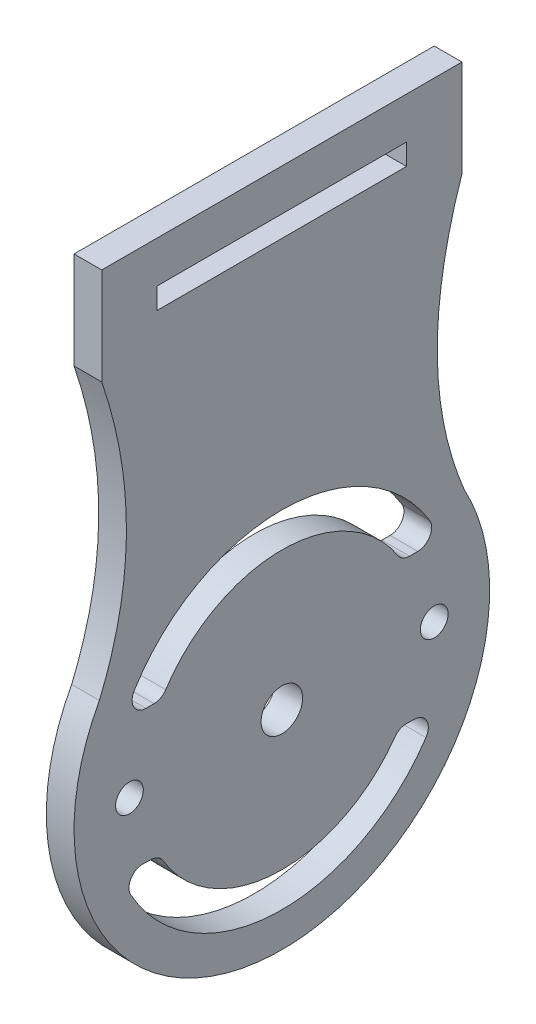
ISO-10303-21;
HEADER;
FILE_DESCRIPTION(('STEP AP214'),'2;1');
FILE_NAME('part.step','',(''),(''),'','','');
FILE_SCHEMA(('AUTOMOTIVE_DESIGN { 1 0 10303 214 1 1 1 1 }'));
ENDSEC;
DATA;
#1=APPLICATION_CONTEXT('core data for automotive mechanical design processes');
#2=APPLICATION_PROTOCOL_DEFINITION('international standard','automotive_design',2000,#1);
#3=PRODUCT_CONTEXT('',#1,'mechanical');
#4=PRODUCT('Part','Part','',(#3));
#5=PRODUCT_RELATED_PRODUCT_CATEGORY('part','',(#4));
#6=PRODUCT_DEFINITION_FORMATION('','',#4);
#7=PRODUCT_DEFINITION_CONTEXT('part definition',#1,'design');
#8=PRODUCT_DEFINITION('design','',#6,#7);
#9=PRODUCT_DEFINITION_SHAPE('','',#8);
#10=(LENGTH_UNIT() NAMED_UNIT(*) SI_UNIT(.MILLI.,.METRE.));
#11=(NAMED_UNIT(*) PLANE_ANGLE_UNIT() SI_UNIT($,.RADIAN.));
#12=(NAMED_UNIT(*) SI_UNIT($,.STERADIAN.) SOLID_ANGLE_UNIT());
#13=UNCERTAINTY_MEASURE_WITH_UNIT(LENGTH_MEASURE(1.E-05),#10,'distance_accuracy_value','');
#14=(GEOMETRIC_REPRESENTATION_CONTEXT(3) GLOBAL_UNCERTAINTY_ASSIGNED_CONTEXT((#13)) GLOBAL_UNIT_ASSIGNED_CONTEXT((#10,
#11,#12)) REPRESENTATION_CONTEXT('',''));
#15=CARTESIAN_POINT('',(0.,0.,0.));
#16=DIRECTION('',(0.,0.,1.));
#17=DIRECTION('',(1.,0.,0.));
#18=AXIS2_PLACEMENT_3D('',#15,#16,#17);
#19=CARTESIAN_POINT('',(2.,27.,13.));
#20=CARTESIAN_POINT('',(2.,16.2399641619766,9.3541994142272));
#21=CARTESIAN_POINT('',(2.,7.1726349857079,13.1739632366953));
#22=B_SPLINE_CURVE_WITH_KNOTS('',2,(#19,#20,#21),.UNSPECIFIED.,.F.,.F.,(3,3),(0.,
0.912495845409906),.UNSPECIFIED.);
#23=DIRECTION('',(-1.,0.,0.));
#24=VECTOR('',#23,1.);
#25=SURFACE_OF_LINEAR_EXTRUSION('',#22,#24);
#26=CARTESIAN_POINT('',(0.,27.,13.));
#27=CARTESIAN_POINT('',(0.,16.2399641619766,9.3541994142272));
#28=CARTESIAN_POINT('',(0.,7.1726349857079,13.1739632366953));
#29=B_SPLINE_CURVE_WITH_KNOTS('',2,(#26,#27,#28),.UNSPECIFIED.,.F.,.F.,(3,3),(0.,
0.912495845409906),.UNSPECIFIED.);
#30=CARTESIAN_POINT('',(0.,27.,13.));
#31=VERTEX_POINT('',#30);
#32=CARTESIAN_POINT('',(0.,7.1726349857079,13.1739632366953));
#33=VERTEX_POINT('',#32);
#34=EDGE_CURVE('E425',#31,#33,#29,.T.);
#35=ORIENTED_EDGE('',*,*,#34,.T.);
#36=DIRECTION('',(-1.,0.,0.));
#37=VECTOR('',#36,1.);
#38=CARTESIAN_POINT('',(2.,7.1726349857079,13.1739632366953));
#39=LINE('',#38,#37);
#40=CARTESIAN_POINT('',(2.,7.1726349857079,13.1739632366953));
#41=VERTEX_POINT('',#40);
#42=EDGE_CURVE('E11',#41,#33,#39,.T.);
#43=ORIENTED_EDGE('',*,*,#42,.F.);
#44=CARTESIAN_POINT('',(2.,27.,13.));
#45=VERTEX_POINT('',#44);
#46=EDGE_CURVE('E443',#45,#41,#22,.T.);
#47=ORIENTED_EDGE('',*,*,#46,.F.);
#48=DIRECTION('',(-1.,0.,0.));
#49=VECTOR('',#48,1.);
#50=CARTESIAN_POINT('',(2.,27.,13.));
#51=LINE('',#50,#49);
#52=EDGE_CURVE('E459',#45,#31,#51,.T.);
#53=ORIENTED_EDGE('',*,*,#52,.T.);
#54=EDGE_LOOP('',(#35,#43,#47,#53));
#55=FACE_BOUND('',#54,.T.);
#56=ADVANCED_FACE('F32',(#55),#25,.F.);
#57=CARTESIAN_POINT('',(2.,0.,0.));
#58=DIRECTION('',(-1.,0.,0.));
#59=DIRECTION('',(0.,0.,1.));
#60=AXIS2_PLACEMENT_3D('',#57,#58,#59);
#61=CYLINDRICAL_SURFACE('',#60,15.);
#62=CARTESIAN_POINT('',(0.,0.,0.));
#63=DIRECTION('',(1.,0.,0.));
#64=DIRECTION('',(0.,0.,-1.));
#65=AXIS2_PLACEMENT_3D('',#62,#63,#64);
#66=CIRCLE('',#65,15.);
#67=CARTESIAN_POINT('',(0.,7.1726349857079,-13.1739632366953));
#68=VERTEX_POINT('',#67);
#69=EDGE_CURVE('E416',#33,#68,#66,.T.);
#70=ORIENTED_EDGE('',*,*,#69,.T.);
#71=DIRECTION('',(-1.,0.,0.));
#72=VECTOR('',#71,1.);
#73=CARTESIAN_POINT('',(2.,7.1726349857079,-13.1739632366953));
#74=LINE('',#73,#72);
#75=CARTESIAN_POINT('',(2.,7.1726349857079,-13.1739632366953));
#76=VERTEX_POINT('',#75);
#77=EDGE_CURVE('E418',#76,#68,#74,.T.);
#78=ORIENTED_EDGE('',*,*,#77,.F.);
#79=CARTESIAN_POINT('',(2.,0.,0.));
#80=DIRECTION('',(1.,0.,0.));
#81=DIRECTION('',(0.,0.,-1.));
#82=AXIS2_PLACEMENT_3D('',#79,#80,#81);
#83=CIRCLE('',#82,15.);
#84=EDGE_CURVE('E449',#41,#76,#83,.T.);
#85=ORIENTED_EDGE('',*,*,#84,.F.);
#86=ORIENTED_EDGE('',*,*,#42,.T.);
#87=EDGE_LOOP('',(#70,#78,#85,#86));
#88=FACE_BOUND('',#87,.T.);
#89=ADVANCED_FACE('F407',(#88),#61,.T.);
#90=CARTESIAN_POINT('',(2.,34.,13.));
#91=DIRECTION('',(0.,-1.,0.));
#92=DIRECTION('',(0.,0.,-1.));
#93=AXIS2_PLACEMENT_3D('',#90,#91,#92);
#94=PLANE('',#93);
#95=DIRECTION('',(0.,0.,1.));
#96=VECTOR('',#95,1.);
#97=CARTESIAN_POINT('',(0.,34.,13.));
#98=LINE('',#97,#96);
#99=CARTESIAN_POINT('',(0.,34.,-13.));
#100=VERTEX_POINT('',#99);
#101=CARTESIAN_POINT('',(0.,34.,13.));
#102=VERTEX_POINT('',#101);
#103=EDGE_CURVE('E424',#100,#102,#98,.T.);
#104=ORIENTED_EDGE('',*,*,#103,.T.);
#105=DIRECTION('',(-1.,0.,0.));
#106=VECTOR('',#105,1.);
#107=CARTESIAN_POINT('',(2.,34.,13.));
#108=LINE('',#107,#106);
#109=CARTESIAN_POINT('',(2.,34.,13.));
#110=VERTEX_POINT('',#109);
#111=EDGE_CURVE('E40',#110,#102,#108,.T.);
#112=ORIENTED_EDGE('',*,*,#111,.F.);
#113=DIRECTION('',(0.,0.,1.));
#114=VECTOR('',#113,1.);
#115=CARTESIAN_POINT('',(2.,34.,13.));
#116=LINE('',#115,#114);
#117=CARTESIAN_POINT('',(2.,34.,-13.));
#118=VERTEX_POINT('',#117);
#119=EDGE_CURVE('E455',#118,#110,#116,.T.);
#120=ORIENTED_EDGE('',*,*,#119,.F.);
#121=DIRECTION('',(-1.,0.,0.));
#122=VECTOR('',#121,1.);
#123=CARTESIAN_POINT('',(2.,34.,-13.));
#124=LINE('',#123,#122);
#125=EDGE_CURVE('E430',#118,#100,#124,.T.);
#126=ORIENTED_EDGE('',*,*,#125,.T.);
#127=EDGE_LOOP('',(#104,#112,#120,#126));
#128=FACE_BOUND('',#127,.T.);
#129=ADVANCED_FACE('F404',(#128),#94,.F.);
#130=CARTESIAN_POINT('',(2.,34.,13.));
#131=DIRECTION('',(0.,0.,-1.));
#132=DIRECTION('',(0.,1.,0.));
#133=AXIS2_PLACEMENT_3D('',#130,#131,#132);
#134=PLANE('',#133);
#135=DIRECTION('',(0.,-1.,0.));
#136=VECTOR('',#135,1.);
#137=CARTESIAN_POINT('',(0.,34.,13.));
#138=LINE('',#137,#136);
#139=EDGE_CURVE('E450',#102,#31,#138,.T.);
#140=ORIENTED_EDGE('',*,*,#139,.T.);
#141=ORIENTED_EDGE('',*,*,#52,.F.);
#142=DIRECTION('',(0.,-1.,0.));
#143=VECTOR('',#142,1.);
#144=CARTESIAN_POINT('',(2.,34.,13.));
#145=LINE('',#144,#143);
#146=EDGE_CURVE('E457',#110,#45,#145,.T.);
#147=ORIENTED_EDGE('',*,*,#146,.F.);
#148=ORIENTED_EDGE('',*,*,#111,.T.);
#149=EDGE_LOOP('',(#140,#141,#147,#148));
#150=FACE_BOUND('',#149,.T.);
#151=ADVANCED_FACE('F397',(#150),#134,.F.);
#152=CARTESIAN_POINT('',(2.,16.6631408274153,11.2205905162874));
#153=DIRECTION('',(1.,0.,0.));
#154=DIRECTION('',(0.,0.,-1.));
#155=AXIS2_PLACEMENT_3D('',#152,#153,#154);
#156=PLANE('',#155);
#157=CARTESIAN_POINT('',(2.,0.,11.));
#158=DIRECTION('',(1.,0.,0.));
#159=DIRECTION('',(0.,0.,-1.));
#160=AXIS2_PLACEMENT_3D('',#157,#158,#159);
#161=CIRCLE('',#160,1.);
#162=CARTESIAN_POINT('',(2.,0.,10.));
#163=VERTEX_POINT('',#162);
#164=EDGE_CURVE('E579',#163,#163,#161,.T.);
#165=ORIENTED_EDGE('',*,*,#164,.F.);
#166=EDGE_LOOP('',(#165));
#167=FACE_BOUND('',#166,.T.);
#168=CARTESIAN_POINT('',(2.,0.,-11.));
#169=DIRECTION('',(1.,0.,0.));
#170=DIRECTION('',(0.,0.,-1.));
#171=AXIS2_PLACEMENT_3D('',#168,#169,#170);
#172=CIRCLE('',#171,1.);
#173=CARTESIAN_POINT('',(2.,0.,-12.));
#174=VERTEX_POINT('',#173);
#175=EDGE_CURVE('E581',#174,#174,#172,.T.);
#176=ORIENTED_EDGE('',*,*,#175,.F.);
#177=EDGE_LOOP('',(#176));
#178=FACE_BOUND('',#177,.T.);
#179=CARTESIAN_POINT('',(2.,0.,0.));
#180=DIRECTION('',(1.,0.,0.));
#181=DIRECTION('',(0.,0.,-1.));
#182=AXIS2_PLACEMENT_3D('',#179,#180,#181);
#183=CIRCLE('',#182,1.5);
#184=CARTESIAN_POINT('',(2.,0.,-1.5));
#185=VERTEX_POINT('',#184);
#186=EDGE_CURVE('E230',#185,#185,#183,.T.);
#187=ORIENTED_EDGE('',*,*,#186,.F.);
#188=EDGE_LOOP('',(#187));
#189=FACE_BOUND('',#188,.T.);
#190=CARTESIAN_POINT('',(2.,6.,-9.21954445729288));
#191=DIRECTION('',(1.,0.,0.));
#192=DIRECTION('',(0.,0.,1.));
#193=AXIS2_PLACEMENT_3D('',#190,#191,#192);
#194=CIRCLE('',#193,0.999999999999998);
#195=CARTESIAN_POINT('',(2.,5.45454545454546,-8.38140405208444));
#196=VERTEX_POINT('',#195);
#197=CARTESIAN_POINT('',(2.,5.,-9.21954445729289));
#198=VERTEX_POINT('',#197);
#199=EDGE_CURVE('E47',#196,#198,#194,.T.);
#200=ORIENTED_EDGE('',*,*,#199,.F.);
#201=CARTESIAN_POINT('',(2.,0.,0.));
#202=DIRECTION('',(-1.,0.,0.));
#203=DIRECTION('',(0.,0.,-1.));
#204=AXIS2_PLACEMENT_3D('',#201,#202,#203);
#205=CIRCLE('',#204,10.);
#206=CARTESIAN_POINT('',(2.,5.45454545454545,8.38140405208445));
#207=VERTEX_POINT('',#206);
#208=EDGE_CURVE('E224',#207,#196,#205,.T.);
#209=ORIENTED_EDGE('',*,*,#208,.F.);
#210=CARTESIAN_POINT('',(2.,6.,9.21954445729289));
#211=DIRECTION('',(1.,0.,0.));
#212=DIRECTION('',(0.,0.,-1.));
#213=AXIS2_PLACEMENT_3D('',#210,#211,#212);
#214=CIRCLE('',#213,1.);
#215=CARTESIAN_POINT('',(2.,5.,9.21954445729289));
#216=VERTEX_POINT('',#215);
#217=EDGE_CURVE('E227',#216,#207,#214,.T.);
#218=ORIENTED_EDGE('',*,*,#217,.F.);
#219=DIRECTION('',(0.,0.,-1.));
#220=VECTOR('',#219,1.);
#221=CARTESIAN_POINT('',(2.,5.,9.81070843517429));
#222=LINE('',#221,#220);
#223=CARTESIAN_POINT('',(2.,5.,9.81070843517429));
#224=VERTEX_POINT('',#223);
#225=EDGE_CURVE('E259',#224,#216,#222,.T.);
#226=ORIENTED_EDGE('',*,*,#225,.F.);
#227=CARTESIAN_POINT('',(2.,6.,9.81070843517429));
#228=DIRECTION('',(1.,0.,0.));
#229=DIRECTION('',(0.,0.,1.));
#230=AXIS2_PLACEMENT_3D('',#227,#228,#229);
#231=CIRCLE('',#230,1.);
#232=CARTESIAN_POINT('',(2.,6.52173913043478,10.6638135164938));
#233=VERTEX_POINT('',#232);
#234=EDGE_CURVE('E256',#233,#224,#231,.T.);
#235=ORIENTED_EDGE('',*,*,#234,.F.);
#236=CARTESIAN_POINT('',(2.,0.,0.));
#237=DIRECTION('',(1.,0.,0.));
#238=DIRECTION('',(0.,0.,-1.));
#239=AXIS2_PLACEMENT_3D('',#236,#237,#238);
#240=CIRCLE('',#239,12.5);
#241=CARTESIAN_POINT('',(2.,6.52173913043478,-10.6638135164938));
#242=VERTEX_POINT('',#241);
#243=EDGE_CURVE('E253',#242,#233,#240,.T.);
#244=ORIENTED_EDGE('',*,*,#243,.F.);
#245=CARTESIAN_POINT('',(2.,6.,-9.8107084351743));
#246=DIRECTION('',(1.,0.,0.));
#247=DIRECTION('',(0.,0.,-1.));
#248=AXIS2_PLACEMENT_3D('',#245,#246,#247);
#249=CIRCLE('',#248,0.999999999999999);
#250=CARTESIAN_POINT('',(2.,5.,-9.8107084351743));
#251=VERTEX_POINT('',#250);
#252=EDGE_CURVE('E250',#251,#242,#249,.T.);
#253=ORIENTED_EDGE('',*,*,#252,.F.);
#254=DIRECTION('',(0.,0.,-1.));
#255=VECTOR('',#254,1.);
#256=CARTESIAN_POINT('',(2.,5.,-9.21954445729288));
#257=LINE('',#256,#255);
#258=EDGE_CURVE('E247',#198,#251,#257,.T.);
#259=ORIENTED_EDGE('',*,*,#258,.F.);
#260=EDGE_LOOP('',(#200,#209,#218,#226,#235,#244,#253,#259));
#261=FACE_BOUND('',#260,.T.);
#262=CARTESIAN_POINT('',(2.,-5.63895967414048,9.44468812578888));
#263=DIRECTION('',(1.,0.,0.));
#264=DIRECTION('',(0.,0.,-1.));
#265=AXIS2_PLACEMENT_3D('',#262,#263,#264);
#266=CIRCLE('',#265,1.);
#267=CARTESIAN_POINT('',(2.,-5.12632697649135,8.58608011435353));
#268=VERTEX_POINT('',#267);
#269=CARTESIAN_POINT('',(2.,-4.6397077724395,9.40601466011852));
#270=VERTEX_POINT('',#269);
#271=EDGE_CURVE('E266',#268,#270,#266,.T.);
#272=ORIENTED_EDGE('',*,*,#271,.F.);
#273=CARTESIAN_POINT('',(2.,0.,0.));
#274=DIRECTION('',(-1.,0.,0.));
#275=DIRECTION('',(0.,0.,-1.));
#276=AXIS2_PLACEMENT_3D('',#273,#274,#275);
#277=CIRCLE('',#276,10.);
#278=CARTESIAN_POINT('',(2.,-5.77460286024672,-8.16418776158599));
#279=VERTEX_POINT('',#278);
#280=EDGE_CURVE('E282',#279,#268,#277,.T.);
#281=ORIENTED_EDGE('',*,*,#280,.F.);
#282=CARTESIAN_POINT('',(2.,-6.35206314627139,-8.98060653774459));
#283=DIRECTION('',(1.,0.,0.));
#284=DIRECTION('',(0.,0.,-1.));
#285=AXIS2_PLACEMENT_3D('',#282,#283,#284);
#286=CIRCLE('',#285,1.);
#287=CARTESIAN_POINT('',(2.,-5.3528112445704,-9.01928000341494));
#288=VERTEX_POINT('',#287);
#289=EDGE_CURVE('E320',#288,#279,#286,.T.);
#290=ORIENTED_EDGE('',*,*,#289,.F.);
#291=DIRECTION('',(0.,0.0386734656703576,0.999251901700989));
#292=VECTOR('',#291,1.);
#293=CARTESIAN_POINT('',(2.,-5.3528112445704,-9.01928000341494));
#294=LINE('',#293,#292);
#295=CARTESIAN_POINT('',(2.,-5.37567360437455,-9.61000173253006));
#296=VERTEX_POINT('',#295);
#297=EDGE_CURVE('E317',#296,#288,#294,.T.);
#298=ORIENTED_EDGE('',*,*,#297,.F.);
#299=CARTESIAN_POINT('',(2.,-6.37492550607554,-9.5713282668597));
#300=DIRECTION('',(1.,0.,0.));
#301=DIRECTION('',(0.,0.,-1.));
#302=AXIS2_PLACEMENT_3D('',#299,#300,#301);
#303=CIRCLE('',#302,1.);
#304=CARTESIAN_POINT('',(2.,-6.92926685442993,-10.4036176813692));
#305=VERTEX_POINT('',#304);
#306=EDGE_CURVE('E314',#305,#296,#303,.T.);
#307=ORIENTED_EDGE('',*,*,#306,.F.);
#308=CARTESIAN_POINT('',(2.,0.,0.));
#309=DIRECTION('',(1.,0.,0.));
#310=DIRECTION('',(0.,0.,-1.));
#311=AXIS2_PLACEMENT_3D('',#308,#309,#310);
#312=CIRCLE('',#311,12.5);
#313=CARTESIAN_POINT('',(2.,-6.10445360253949,10.908054190113));
#314=VERTEX_POINT('',#313);
#315=EDGE_CURVE('E311',#314,#305,#312,.T.);
#316=ORIENTED_EDGE('',*,*,#315,.F.);
#317=CARTESIAN_POINT('',(2.,-5.61609731433633,10.035409854904));
#318=DIRECTION('',(1.,0.,0.));
#319=DIRECTION('',(0.,0.,-1.));
#320=AXIS2_PLACEMENT_3D('',#317,#318,#319);
#321=CIRCLE('',#320,0.999999999999999);
#322=CARTESIAN_POINT('',(2.,-4.61684541263534,9.99673638923364));
#323=VERTEX_POINT('',#322);
#324=EDGE_CURVE('E308',#323,#314,#321,.T.);
#325=ORIENTED_EDGE('',*,*,#324,.F.);
#326=DIRECTION('',(0.,0.0386734656703574,0.999251901700989));
#327=VECTOR('',#326,1.);
#328=CARTESIAN_POINT('',(2.,-4.61684541263534,9.99673638923364));
#329=LINE('',#328,#327);
#330=EDGE_CURVE('E305',#270,#323,#329,.T.);
#331=ORIENTED_EDGE('',*,*,#330,.F.);
#332=EDGE_LOOP('',(#272,#281,#290,#298,#307,#316,#325,#331));
#333=FACE_BOUND('',#332,.T.);
#334=DIRECTION('',(0.,1.,0.));
#335=VECTOR('',#334,1.);
#336=CARTESIAN_POINT('',(2.,31.,-9.));
#337=LINE('',#336,#335);
#338=CARTESIAN_POINT('',(2.,29.4721192150516,-9.));
#339=VERTEX_POINT('',#338);
#340=CARTESIAN_POINT('',(2.,31.,-9.));
#341=VERTEX_POINT('',#340);
#342=EDGE_CURVE('E327',#339,#341,#337,.T.);
#343=ORIENTED_EDGE('',*,*,#342,.F.);
#344=DIRECTION('',(0.,0.,-1.));
#345=VECTOR('',#344,1.);
#346=CARTESIAN_POINT('',(2.,29.4721192150516,9.));
#347=LINE('',#346,#345);
#348=CARTESIAN_POINT('',(2.,29.4721192150516,9.));
#349=VERTEX_POINT('',#348);
#350=EDGE_CURVE('E346',#349,#339,#347,.T.);
#351=ORIENTED_EDGE('',*,*,#350,.F.);
#352=DIRECTION('',(0.,-1.,0.));
#353=VECTOR('',#352,1.);
#354=CARTESIAN_POINT('',(2.,31.,9.));
#355=LINE('',#354,#353);
#356=CARTESIAN_POINT('',(2.,31.,9.));
#357=VERTEX_POINT('',#356);
#358=EDGE_CURVE('E360',#357,#349,#355,.T.);
#359=ORIENTED_EDGE('',*,*,#358,.F.);
#360=DIRECTION('',(0.,0.,1.));
#361=VECTOR('',#360,1.);
#362=CARTESIAN_POINT('',(2.,31.,9.));
#363=LINE('',#362,#361);
#364=EDGE_CURVE('E357',#341,#357,#363,.T.);
#365=ORIENTED_EDGE('',*,*,#364,.F.);
#366=EDGE_LOOP('',(#343,#351,#359,#365));
#367=FACE_BOUND('',#366,.T.);
#368=ORIENTED_EDGE('',*,*,#46,.T.);
#369=ORIENTED_EDGE('',*,*,#84,.T.);
#370=CARTESIAN_POINT('',(2.,27.,-13.));
#371=CARTESIAN_POINT('',(2.,16.2399641619766,-9.3541994142272));
#372=CARTESIAN_POINT('',(2.,7.1726349857079,-13.1739632366953));
#373=B_SPLINE_CURVE_WITH_KNOTS('',2,(#370,#371,#372),.UNSPECIFIED.,.F.,.F.,(3,3),(0.,
0.912495845409906),.UNSPECIFIED.);
#374=CARTESIAN_POINT('',(2.,27.,-13.));
#375=VERTEX_POINT('',#374);
#376=EDGE_CURVE('E374',#375,#76,#373,.T.);
#377=ORIENTED_EDGE('',*,*,#376,.F.);
#378=DIRECTION('',(0.,-1.,0.));
#379=VECTOR('',#378,1.);
#380=CARTESIAN_POINT('',(2.,34.,-13.));
#381=LINE('',#380,#379);
#382=EDGE_CURVE('E380',#118,#375,#381,.T.);
#383=ORIENTED_EDGE('',*,*,#382,.F.);
#384=ORIENTED_EDGE('',*,*,#119,.T.);
#385=ORIENTED_EDGE('',*,*,#146,.T.);
#386=EDGE_LOOP('',(#368,#369,#377,#383,#384,#385));
#387=FACE_BOUND('',#386,.T.);
#388=ADVANCED_FACE('F394',(#167,#178,#189,#261,#333,#367,#387),#156,.T.);
#389=CARTESIAN_POINT('',(0.,16.6631408274153,11.2205905162874));
#390=DIRECTION('',(1.,0.,0.));
#391=DIRECTION('',(0.,0.,-1.));
#392=AXIS2_PLACEMENT_3D('',#389,#390,#391);
#393=PLANE('',#392);
#394=CARTESIAN_POINT('',(0.,0.,11.));
#395=DIRECTION('',(1.,0.,0.));
#396=DIRECTION('',(0.,0.,-1.));
#397=AXIS2_PLACEMENT_3D('',#394,#395,#396);
#398=CIRCLE('',#397,1.);
#399=CARTESIAN_POINT('',(0.,0.,10.));
#400=VERTEX_POINT('',#399);
#401=EDGE_CURVE('E576',#400,#400,#398,.T.);
#402=ORIENTED_EDGE('',*,*,#401,.T.);
#403=EDGE_LOOP('',(#402));
#404=FACE_BOUND('',#403,.T.);
#405=CARTESIAN_POINT('',(0.,0.,-11.));
#406=DIRECTION('',(1.,0.,0.));
#407=DIRECTION('',(0.,0.,-1.));
#408=AXIS2_PLACEMENT_3D('',#405,#406,#407);
#409=CIRCLE('',#408,1.);
#410=CARTESIAN_POINT('',(0.,0.,-12.));
#411=VERTEX_POINT('',#410);
#412=EDGE_CURVE('E584',#411,#411,#409,.T.);
#413=ORIENTED_EDGE('',*,*,#412,.T.);
#414=EDGE_LOOP('',(#413));
#415=FACE_BOUND('',#414,.T.);
#416=CARTESIAN_POINT('',(0.,0.,0.));
#417=DIRECTION('',(1.,0.,0.));
#418=DIRECTION('',(0.,0.,-1.));
#419=AXIS2_PLACEMENT_3D('',#416,#417,#418);
#420=CIRCLE('',#419,1.5);
#421=CARTESIAN_POINT('',(0.,0.,-1.5));
#422=VERTEX_POINT('',#421);
#423=EDGE_CURVE('E248',#422,#422,#420,.T.);
#424=ORIENTED_EDGE('',*,*,#423,.T.);
#425=EDGE_LOOP('',(#424));
#426=FACE_BOUND('',#425,.T.);
#427=CARTESIAN_POINT('',(0.,0.,0.));
#428=DIRECTION('',(-1.,0.,0.));
#429=DIRECTION('',(0.,0.,-1.));
#430=AXIS2_PLACEMENT_3D('',#427,#428,#429);
#431=CIRCLE('',#430,10.);
#432=CARTESIAN_POINT('',(0.,5.45454545454545,8.38140405208445));
#433=VERTEX_POINT('',#432);
#434=CARTESIAN_POINT('',(0.,5.45454545454546,-8.38140405208444));
#435=VERTEX_POINT('',#434);
#436=EDGE_CURVE('E213',#433,#435,#431,.T.);
#437=ORIENTED_EDGE('',*,*,#436,.T.);
#438=CARTESIAN_POINT('',(0.,6.,-9.21954445729288));
#439=DIRECTION('',(1.,0.,0.));
#440=DIRECTION('',(0.,0.,1.));
#441=AXIS2_PLACEMENT_3D('',#438,#439,#440);
#442=CIRCLE('',#441,0.999999999999998);
#443=CARTESIAN_POINT('',(0.,5.,-9.21954445729288));
#444=VERTEX_POINT('',#443);
#445=EDGE_CURVE('E207',#435,#444,#442,.T.);
#446=ORIENTED_EDGE('',*,*,#445,.T.);
#447=DIRECTION('',(0.,0.,-1.));
#448=VECTOR('',#447,1.);
#449=CARTESIAN_POINT('',(0.,5.,-9.21954445729288));
#450=LINE('',#449,#448);
#451=CARTESIAN_POINT('',(0.,5.,-9.81070843517429));
#452=VERTEX_POINT('',#451);
#453=EDGE_CURVE('E216',#444,#452,#450,.T.);
#454=ORIENTED_EDGE('',*,*,#453,.T.);
#455=CARTESIAN_POINT('',(0.,6.,-9.8107084351743));
#456=DIRECTION('',(1.,0.,0.));
#457=DIRECTION('',(0.,0.,-1.));
#458=AXIS2_PLACEMENT_3D('',#455,#456,#457);
#459=CIRCLE('',#458,0.999999999999999);
#460=CARTESIAN_POINT('',(0.,6.52173913043478,-10.6638135164938));
#461=VERTEX_POINT('',#460);
#462=EDGE_CURVE('E55',#452,#461,#459,.T.);
#463=ORIENTED_EDGE('',*,*,#462,.T.);
#464=CARTESIAN_POINT('',(0.,0.,0.));
#465=DIRECTION('',(1.,0.,0.));
#466=DIRECTION('',(0.,0.,-1.));
#467=AXIS2_PLACEMENT_3D('',#464,#465,#466);
#468=CIRCLE('',#467,12.5);
#469=CARTESIAN_POINT('',(0.,6.52173913043478,10.6638135164938));
#470=VERTEX_POINT('',#469);
#471=EDGE_CURVE('E234',#461,#470,#468,.T.);
#472=ORIENTED_EDGE('',*,*,#471,.T.);
#473=CARTESIAN_POINT('',(0.,6.,9.81070843517429));
#474=DIRECTION('',(1.,0.,0.));
#475=DIRECTION('',(0.,0.,1.));
#476=AXIS2_PLACEMENT_3D('',#473,#474,#475);
#477=CIRCLE('',#476,1.);
#478=CARTESIAN_POINT('',(0.,5.,9.81070843517429));
#479=VERTEX_POINT('',#478);
#480=EDGE_CURVE('E237',#470,#479,#477,.T.);
#481=ORIENTED_EDGE('',*,*,#480,.T.);
#482=DIRECTION('',(0.,0.,-1.));
#483=VECTOR('',#482,1.);
#484=CARTESIAN_POINT('',(0.,5.,9.81070843517429));
#485=LINE('',#484,#483);
#486=CARTESIAN_POINT('',(0.,5.,9.21954445729289));
#487=VERTEX_POINT('',#486);
#488=EDGE_CURVE('E240',#479,#487,#485,.T.);
#489=ORIENTED_EDGE('',*,*,#488,.T.);
#490=CARTESIAN_POINT('',(0.,6.,9.21954445729289));
#491=DIRECTION('',(1.,0.,0.));
#492=DIRECTION('',(0.,0.,-1.));
#493=AXIS2_PLACEMENT_3D('',#490,#491,#492);
#494=CIRCLE('',#493,1.);
#495=EDGE_CURVE('E243',#487,#433,#494,.T.);
#496=ORIENTED_EDGE('',*,*,#495,.T.);
#497=EDGE_LOOP('',(#437,#446,#454,#463,#472,#481,#489,#496));
#498=FACE_BOUND('',#497,.T.);
#499=CARTESIAN_POINT('',(0.,0.,0.));
#500=DIRECTION('',(-1.,0.,0.));
#501=DIRECTION('',(0.,0.,-1.));
#502=AXIS2_PLACEMENT_3D('',#499,#500,#501);
#503=CIRCLE('',#502,10.);
#504=CARTESIAN_POINT('',(0.,-5.77460286024672,-8.16418776158599));
#505=VERTEX_POINT('',#504);
#506=CARTESIAN_POINT('',(0.,-5.12632697649135,8.58608011435353));
#507=VERTEX_POINT('',#506);
#508=EDGE_CURVE('E300',#505,#507,#503,.T.);
#509=ORIENTED_EDGE('',*,*,#508,.T.);
#510=CARTESIAN_POINT('',(0.,-5.63895967414048,9.44468812578888));
#511=DIRECTION('',(1.,0.,0.));
#512=DIRECTION('',(0.,0.,-1.));
#513=AXIS2_PLACEMENT_3D('',#510,#511,#512);
#514=CIRCLE('',#513,1.);
#515=CARTESIAN_POINT('',(0.,-4.63970777243949,9.40601466011852));
#516=VERTEX_POINT('',#515);
#517=EDGE_CURVE('E278',#507,#516,#514,.T.);
#518=ORIENTED_EDGE('',*,*,#517,.T.);
#519=DIRECTION('',(0.,0.0386734656703574,0.999251901700989));
#520=VECTOR('',#519,1.);
#521=CARTESIAN_POINT('',(0.,-4.61684541263534,9.99673638923364));
#522=LINE('',#521,#520);
#523=CARTESIAN_POINT('',(0.,-4.61684541263535,9.99673638923364));
#524=VERTEX_POINT('',#523);
#525=EDGE_CURVE('E281',#516,#524,#522,.T.);
#526=ORIENTED_EDGE('',*,*,#525,.T.);
#527=CARTESIAN_POINT('',(0.,-5.61609731433633,10.035409854904));
#528=DIRECTION('',(1.,0.,0.));
#529=DIRECTION('',(0.,0.,-1.));
#530=AXIS2_PLACEMENT_3D('',#527,#528,#529);
#531=CIRCLE('',#530,0.999999999999999);
#532=CARTESIAN_POINT('',(0.,-6.10445360253949,10.908054190113));
#533=VERTEX_POINT('',#532);
#534=EDGE_CURVE('E285',#524,#533,#531,.T.);
#535=ORIENTED_EDGE('',*,*,#534,.T.);
#536=CARTESIAN_POINT('',(0.,0.,0.));
#537=DIRECTION('',(1.,0.,0.));
#538=DIRECTION('',(0.,0.,-1.));
#539=AXIS2_PLACEMENT_3D('',#536,#537,#538);
#540=CIRCLE('',#539,12.5);
#541=CARTESIAN_POINT('',(0.,-6.92926685442993,-10.4036176813692));
#542=VERTEX_POINT('',#541);
#543=EDGE_CURVE('E288',#533,#542,#540,.T.);
#544=ORIENTED_EDGE('',*,*,#543,.T.);
#545=CARTESIAN_POINT('',(0.,-6.37492550607554,-9.5713282668597));
#546=DIRECTION('',(1.,0.,0.));
#547=DIRECTION('',(0.,0.,-1.));
#548=AXIS2_PLACEMENT_3D('',#545,#546,#547);
#549=CIRCLE('',#548,1.);
#550=CARTESIAN_POINT('',(0.,-5.37567360437455,-9.61000173253006));
#551=VERTEX_POINT('',#550);
#552=EDGE_CURVE('E291',#542,#551,#549,.T.);
#553=ORIENTED_EDGE('',*,*,#552,.T.);
#554=DIRECTION('',(0.,0.0386734656703576,0.999251901700989));
#555=VECTOR('',#554,1.);
#556=CARTESIAN_POINT('',(0.,-5.3528112445704,-9.01928000341494));
#557=LINE('',#556,#555);
#558=CARTESIAN_POINT('',(0.,-5.3528112445704,-9.01928000341494));
#559=VERTEX_POINT('',#558);
#560=EDGE_CURVE('E294',#551,#559,#557,.T.);
#561=ORIENTED_EDGE('',*,*,#560,.T.);
#562=CARTESIAN_POINT('',(0.,-6.35206314627139,-8.98060653774459));
#563=DIRECTION('',(1.,0.,0.));
#564=DIRECTION('',(0.,0.,-1.));
#565=AXIS2_PLACEMENT_3D('',#562,#563,#564);
#566=CIRCLE('',#565,1.);
#567=EDGE_CURVE('E297',#559,#505,#566,.T.);
#568=ORIENTED_EDGE('',*,*,#567,.T.);
#569=EDGE_LOOP('',(#509,#518,#526,#535,#544,#553,#561,#568));
#570=FACE_BOUND('',#569,.T.);
#571=DIRECTION('',(0.,0.,-1.));
#572=VECTOR('',#571,1.);
#573=CARTESIAN_POINT('',(0.,29.4721192150516,9.));
#574=LINE('',#573,#572);
#575=CARTESIAN_POINT('',(0.,29.4721192150516,9.));
#576=VERTEX_POINT('',#575);
#577=CARTESIAN_POINT('',(0.,29.4721192150516,-9.));
#578=VERTEX_POINT('',#577);
#579=EDGE_CURVE('E352',#576,#578,#574,.T.);
#580=ORIENTED_EDGE('',*,*,#579,.T.);
#581=DIRECTION('',(0.,1.,0.));
#582=VECTOR('',#581,1.);
#583=CARTESIAN_POINT('',(0.,31.,-9.));
#584=LINE('',#583,#582);
#585=CARTESIAN_POINT('',(0.,31.,-9.));
#586=VERTEX_POINT('',#585);
#587=EDGE_CURVE('E342',#578,#586,#584,.T.);
#588=ORIENTED_EDGE('',*,*,#587,.T.);
#589=DIRECTION('',(0.,0.,1.));
#590=VECTOR('',#589,1.);
#591=CARTESIAN_POINT('',(0.,31.,9.));
#592=LINE('',#591,#590);
#593=CARTESIAN_POINT('',(0.,31.,9.));
#594=VERTEX_POINT('',#593);
#595=EDGE_CURVE('E345',#586,#594,#592,.T.);
#596=ORIENTED_EDGE('',*,*,#595,.T.);
#597=DIRECTION('',(0.,-1.,0.));
#598=VECTOR('',#597,1.);
#599=CARTESIAN_POINT('',(0.,31.,9.));
#600=LINE('',#599,#598);
#601=EDGE_CURVE('E349',#594,#576,#600,.T.);
#602=ORIENTED_EDGE('',*,*,#601,.T.);
#603=EDGE_LOOP('',(#580,#588,#596,#602));
#604=FACE_BOUND('',#603,.T.);
#605=ORIENTED_EDGE('',*,*,#34,.F.);
#606=ORIENTED_EDGE('',*,*,#139,.F.);
#607=ORIENTED_EDGE('',*,*,#103,.F.);
#608=DIRECTION('',(0.,-1.,0.));
#609=VECTOR('',#608,1.);
#610=CARTESIAN_POINT('',(0.,34.,-13.));
#611=LINE('',#610,#609);
#612=CARTESIAN_POINT('',(0.,27.,-13.));
#613=VERTEX_POINT('',#612);
#614=EDGE_CURVE('E381',#100,#613,#611,.T.);
#615=ORIENTED_EDGE('',*,*,#614,.T.);
#616=CARTESIAN_POINT('',(0.,27.,-13.));
#617=CARTESIAN_POINT('',(0.,16.2399641619766,-9.3541994142272));
#618=CARTESIAN_POINT('',(0.,7.1726349857079,-13.1739632366953));
#619=B_SPLINE_CURVE_WITH_KNOTS('',2,(#616,#617,#618),.UNSPECIFIED.,.F.,.F.,(3,3),(0.,
0.912495845409906),.UNSPECIFIED.);
#620=EDGE_CURVE('E367',#613,#68,#619,.T.);
#621=ORIENTED_EDGE('',*,*,#620,.T.);
#622=ORIENTED_EDGE('',*,*,#69,.F.);
#623=EDGE_LOOP('',(#605,#606,#607,#615,#621,#622));
#624=FACE_BOUND('',#623,.T.);
#625=ADVANCED_FACE('F220',(#404,#415,#426,#498,#570,#604,#624),#393,.F.);
#626=DIRECTION('',(-1.,0.,0.));
#627=VECTOR('',#626,1.);
#628=SURFACE_OF_LINEAR_EXTRUSION('',#373,#627);
#629=ORIENTED_EDGE('',*,*,#620,.F.);
#630=DIRECTION('',(-1.,0.,0.));
#631=VECTOR('',#630,1.);
#632=CARTESIAN_POINT('',(2.,27.,-13.));
#633=LINE('',#632,#631);
#634=EDGE_CURVE('E442',#375,#613,#633,.T.);
#635=ORIENTED_EDGE('',*,*,#634,.F.);
#636=ORIENTED_EDGE('',*,*,#376,.T.);
#637=ORIENTED_EDGE('',*,*,#77,.T.);
#638=EDGE_LOOP('',(#629,#635,#636,#637));
#639=FACE_BOUND('',#638,.T.);
#640=ADVANCED_FACE('F387',(#639),#628,.T.);
#641=CARTESIAN_POINT('',(2.,34.,-13.));
#642=DIRECTION('',(0.,0.,-1.));
#643=DIRECTION('',(0.,1.,0.));
#644=AXIS2_PLACEMENT_3D('',#641,#642,#643);
#645=PLANE('',#644);
#646=ORIENTED_EDGE('',*,*,#614,.F.);
#647=ORIENTED_EDGE('',*,*,#125,.F.);
#648=ORIENTED_EDGE('',*,*,#382,.T.);
#649=ORIENTED_EDGE('',*,*,#634,.T.);
#650=EDGE_LOOP('',(#646,#647,#648,#649));
#651=FACE_BOUND('',#650,.T.);
#652=ADVANCED_FACE('F391',(#651),#645,.T.);
#653=CARTESIAN_POINT('',(0.,31.,-9.));
#654=DIRECTION('',(0.,0.,-1.));
#655=DIRECTION('',(-1.,0.,0.));
#656=AXIS2_PLACEMENT_3D('',#653,#654,#655);
#657=PLANE('',#656);
#658=ORIENTED_EDGE('',*,*,#342,.T.);
#659=DIRECTION('',(1.,0.,0.));
#660=VECTOR('',#659,1.);
#661=CARTESIAN_POINT('',(0.,31.,-9.));
#662=LINE('',#661,#660);
#663=EDGE_CURVE('E355',#586,#341,#662,.T.);
#664=ORIENTED_EDGE('',*,*,#663,.F.);
#665=ORIENTED_EDGE('',*,*,#587,.F.);
#666=DIRECTION('',(1.,0.,0.));
#667=VECTOR('',#666,1.);
#668=CARTESIAN_POINT('',(0.,29.4721192150516,-9.));
#669=LINE('',#668,#667);
#670=EDGE_CURVE('E365',#578,#339,#669,.T.);
#671=ORIENTED_EDGE('',*,*,#670,.T.);
#672=EDGE_LOOP('',(#658,#664,#665,#671));
#673=FACE_BOUND('',#672,.T.);
#674=ADVANCED_FACE('F481',(#673),#657,.F.);
#675=CARTESIAN_POINT('',(0.,29.4721192150516,9.));
#676=DIRECTION('',(0.,-1.,0.));
#677=DIRECTION('',(0.,0.,-1.));
#678=AXIS2_PLACEMENT_3D('',#675,#676,#677);
#679=PLANE('',#678);
#680=ORIENTED_EDGE('',*,*,#350,.T.);
#681=ORIENTED_EDGE('',*,*,#670,.F.);
#682=ORIENTED_EDGE('',*,*,#579,.F.);
#683=DIRECTION('',(1.,0.,0.));
#684=VECTOR('',#683,1.);
#685=CARTESIAN_POINT('',(0.,29.4721192150516,9.));
#686=LINE('',#685,#684);
#687=EDGE_CURVE('E368',#576,#349,#686,.T.);
#688=ORIENTED_EDGE('',*,*,#687,.T.);
#689=EDGE_LOOP('',(#680,#681,#682,#688));
#690=FACE_BOUND('',#689,.T.);
#691=ADVANCED_FACE('F485',(#690),#679,.F.);
#692=CARTESIAN_POINT('',(0.,31.,9.));
#693=DIRECTION('',(0.,0.,1.));
#694=DIRECTION('',(1.,0.,0.));
#695=AXIS2_PLACEMENT_3D('',#692,#693,#694);
#696=PLANE('',#695);
#697=ORIENTED_EDGE('',*,*,#358,.T.);
#698=ORIENTED_EDGE('',*,*,#687,.F.);
#699=ORIENTED_EDGE('',*,*,#601,.F.);
#700=DIRECTION('',(1.,0.,0.));
#701=VECTOR('',#700,1.);
#702=CARTESIAN_POINT('',(0.,31.,9.));
#703=LINE('',#702,#701);
#704=EDGE_CURVE('E370',#594,#357,#703,.T.);
#705=ORIENTED_EDGE('',*,*,#704,.T.);
#706=EDGE_LOOP('',(#697,#698,#699,#705));
#707=FACE_BOUND('',#706,.T.);
#708=ADVANCED_FACE('F490',(#707),#696,.F.);
#709=CARTESIAN_POINT('',(0.,31.,9.));
#710=DIRECTION('',(0.,1.,0.));
#711=DIRECTION('',(0.,0.,1.));
#712=AXIS2_PLACEMENT_3D('',#709,#710,#711);
#713=PLANE('',#712);
#714=ORIENTED_EDGE('',*,*,#364,.T.);
#715=ORIENTED_EDGE('',*,*,#704,.F.);
#716=ORIENTED_EDGE('',*,*,#595,.F.);
#717=ORIENTED_EDGE('',*,*,#663,.T.);
#718=EDGE_LOOP('',(#714,#715,#716,#717));
#719=FACE_BOUND('',#718,.T.);
#720=ADVANCED_FACE('F494',(#719),#713,.F.);
#721=CARTESIAN_POINT('',(0.,-5.63895967414048,9.44468812578888));
#722=DIRECTION('',(1.,0.,0.));
#723=DIRECTION('',(0.,0.,-1.));
#724=AXIS2_PLACEMENT_3D('',#721,#722,#723);
#725=CYLINDRICAL_SURFACE('',#724,1.);
#726=ORIENTED_EDGE('',*,*,#271,.T.);
#727=DIRECTION('',(1.,0.,0.));
#728=VECTOR('',#727,1.);
#729=CARTESIAN_POINT('',(0.,-4.63970777243949,9.40601466011852));
#730=LINE('',#729,#728);
#731=EDGE_CURVE('E303',#516,#270,#730,.T.);
#732=ORIENTED_EDGE('',*,*,#731,.F.);
#733=ORIENTED_EDGE('',*,*,#517,.F.);
#734=DIRECTION('',(1.,0.,0.));
#735=VECTOR('',#734,1.);
#736=CARTESIAN_POINT('',(0.,-5.12632697649135,8.58608011435353));
#737=LINE('',#736,#735);
#738=EDGE_CURVE('E325',#507,#268,#737,.T.);
#739=ORIENTED_EDGE('',*,*,#738,.T.);
#740=EDGE_LOOP('',(#726,#732,#733,#739));
#741=FACE_BOUND('',#740,.T.);
#742=ADVANCED_FACE('F497',(#741),#725,.F.);
#743=CARTESIAN_POINT('',(0.,0.,0.));
#744=DIRECTION('',(1.,0.,0.));
#745=DIRECTION('',(0.,0.,-1.));
#746=AXIS2_PLACEMENT_3D('',#743,#744,#745);
#747=CYLINDRICAL_SURFACE('',#746,10.);
#748=ORIENTED_EDGE('',*,*,#280,.T.);
#749=ORIENTED_EDGE('',*,*,#738,.F.);
#750=ORIENTED_EDGE('',*,*,#508,.F.);
#751=DIRECTION('',(1.,0.,0.));
#752=VECTOR('',#751,1.);
#753=CARTESIAN_POINT('',(0.,-5.77460286024672,-8.16418776158599));
#754=LINE('',#753,#752);
#755=EDGE_CURVE('E328',#505,#279,#754,.T.);
#756=ORIENTED_EDGE('',*,*,#755,.T.);
#757=EDGE_LOOP('',(#748,#749,#750,#756));
#758=FACE_BOUND('',#757,.T.);
#759=ADVANCED_FACE('F504',(#758),#747,.T.);
#760=CARTESIAN_POINT('',(0.,-6.35206314627139,-8.98060653774459));
#761=DIRECTION('',(1.,0.,0.));
#762=DIRECTION('',(0.,0.,-1.));
#763=AXIS2_PLACEMENT_3D('',#760,#761,#762);
#764=CYLINDRICAL_SURFACE('',#763,1.);
#765=ORIENTED_EDGE('',*,*,#289,.T.);
#766=ORIENTED_EDGE('',*,*,#755,.F.);
#767=ORIENTED_EDGE('',*,*,#567,.F.);
#768=DIRECTION('',(1.,0.,0.));
#769=VECTOR('',#768,1.);
#770=CARTESIAN_POINT('',(0.,-5.3528112445704,-9.01928000341494));
#771=LINE('',#770,#769);
#772=EDGE_CURVE('E330',#559,#288,#771,.T.);
#773=ORIENTED_EDGE('',*,*,#772,.T.);
#774=EDGE_LOOP('',(#765,#766,#767,#773));
#775=FACE_BOUND('',#774,.T.);
#776=ADVANCED_FACE('F525',(#775),#764,.F.);
#777=CARTESIAN_POINT('',(0.,-5.3528112445704,-9.01928000341494));
#778=DIRECTION('',(0.,0.999251901700989,-0.0386734656703576));
#779=DIRECTION('',(0.,0.0386734656703576,0.99925190170099));
#780=AXIS2_PLACEMENT_3D('',#777,#778,#779);
#781=PLANE('',#780);
#782=ORIENTED_EDGE('',*,*,#297,.T.);
#783=ORIENTED_EDGE('',*,*,#772,.F.);
#784=ORIENTED_EDGE('',*,*,#560,.F.);
#785=DIRECTION('',(1.,0.,0.));
#786=VECTOR('',#785,1.);
#787=CARTESIAN_POINT('',(0.,-5.37567360437455,-9.61000173253006));
#788=LINE('',#787,#786);
#789=EDGE_CURVE('E332',#551,#296,#788,.T.);
#790=ORIENTED_EDGE('',*,*,#789,.T.);
#791=EDGE_LOOP('',(#782,#783,#784,#790));
#792=FACE_BOUND('',#791,.T.);
#793=ADVANCED_FACE('F521',(#792),#781,.F.);
#794=CARTESIAN_POINT('',(0.,-6.37492550607554,-9.5713282668597));
#795=DIRECTION('',(1.,0.,0.));
#796=DIRECTION('',(0.,0.,-1.));
#797=AXIS2_PLACEMENT_3D('',#794,#795,#796);
#798=CYLINDRICAL_SURFACE('',#797,1.);
#799=ORIENTED_EDGE('',*,*,#306,.T.);
#800=ORIENTED_EDGE('',*,*,#789,.F.);
#801=ORIENTED_EDGE('',*,*,#552,.F.);
#802=DIRECTION('',(1.,0.,0.));
#803=VECTOR('',#802,1.);
#804=CARTESIAN_POINT('',(0.,-6.92926685442993,-10.4036176813692));
#805=LINE('',#804,#803);
#806=EDGE_CURVE('E334',#542,#305,#805,.T.);
#807=ORIENTED_EDGE('',*,*,#806,.T.);
#808=EDGE_LOOP('',(#799,#800,#801,#807));
#809=FACE_BOUND('',#808,.T.);
#810=ADVANCED_FACE('F517',(#809),#798,.F.);
#811=CARTESIAN_POINT('',(0.,0.,0.));
#812=DIRECTION('',(1.,0.,0.));
#813=DIRECTION('',(0.,0.,-1.));
#814=AXIS2_PLACEMENT_3D('',#811,#812,#813);
#815=CYLINDRICAL_SURFACE('',#814,12.5);
#816=ORIENTED_EDGE('',*,*,#315,.T.);
#817=ORIENTED_EDGE('',*,*,#806,.F.);
#818=ORIENTED_EDGE('',*,*,#543,.F.);
#819=DIRECTION('',(1.,0.,0.));
#820=VECTOR('',#819,1.);
#821=CARTESIAN_POINT('',(0.,-6.10445360253949,10.908054190113));
#822=LINE('',#821,#820);
#823=EDGE_CURVE('E336',#533,#314,#822,.T.);
#824=ORIENTED_EDGE('',*,*,#823,.T.);
#825=EDGE_LOOP('',(#816,#817,#818,#824));
#826=FACE_BOUND('',#825,.T.);
#827=ADVANCED_FACE('F513',(#826),#815,.F.);
#828=CARTESIAN_POINT('',(0.,-5.61609731433633,10.035409854904));
#829=DIRECTION('',(1.,0.,0.));
#830=DIRECTION('',(0.,0.,-1.));
#831=AXIS2_PLACEMENT_3D('',#828,#829,#830);
#832=CYLINDRICAL_SURFACE('',#831,0.999999999999999);
#833=ORIENTED_EDGE('',*,*,#324,.T.);
#834=ORIENTED_EDGE('',*,*,#823,.F.);
#835=ORIENTED_EDGE('',*,*,#534,.F.);
#836=DIRECTION('',(1.,0.,0.));
#837=VECTOR('',#836,1.);
#838=CARTESIAN_POINT('',(0.,-4.61684541263534,9.99673638923364));
#839=LINE('',#838,#837);
#840=EDGE_CURVE('E338',#524,#323,#839,.T.);
#841=ORIENTED_EDGE('',*,*,#840,.T.);
#842=EDGE_LOOP('',(#833,#834,#835,#841));
#843=FACE_BOUND('',#842,.T.);
#844=ADVANCED_FACE('F509',(#843),#832,.F.);
#845=CARTESIAN_POINT('',(0.,-4.61684541263534,9.99673638923364));
#846=DIRECTION('',(0.,0.999251901700989,-0.0386734656703574));
#847=DIRECTION('',(0.,0.0386734656703574,0.99925190170099));
#848=AXIS2_PLACEMENT_3D('',#845,#846,#847);
#849=PLANE('',#848);
#850=ORIENTED_EDGE('',*,*,#330,.T.);
#851=ORIENTED_EDGE('',*,*,#840,.F.);
#852=ORIENTED_EDGE('',*,*,#525,.F.);
#853=ORIENTED_EDGE('',*,*,#731,.T.);
#854=EDGE_LOOP('',(#850,#851,#852,#853));
#855=FACE_BOUND('',#854,.T.);
#856=ADVANCED_FACE('F506',(#855),#849,.F.);
#857=CARTESIAN_POINT('',(0.,6.,-9.21954445729288));
#858=DIRECTION('',(1.,0.,0.));
#859=DIRECTION('',(0.,0.,-1.));
#860=AXIS2_PLACEMENT_3D('',#857,#858,#859);
#861=CYLINDRICAL_SURFACE('',#860,0.999999999999998);
#862=ORIENTED_EDGE('',*,*,#199,.T.);
#863=DIRECTION('',(1.,0.,0.));
#864=VECTOR('',#863,1.);
#865=CARTESIAN_POINT('',(0.,5.,-9.21954445729288));
#866=LINE('',#865,#864);
#867=EDGE_CURVE('E203',#444,#198,#866,.T.);
#868=ORIENTED_EDGE('',*,*,#867,.F.);
#869=ORIENTED_EDGE('',*,*,#445,.F.);
#870=DIRECTION('',(1.,0.,0.));
#871=VECTOR('',#870,1.);
#872=CARTESIAN_POINT('',(0.,5.45454545454546,-8.38140405208444));
#873=LINE('',#872,#871);
#874=EDGE_CURVE('E264',#435,#196,#873,.T.);
#875=ORIENTED_EDGE('',*,*,#874,.T.);
#876=EDGE_LOOP('',(#862,#868,#869,#875));
#877=FACE_BOUND('',#876,.T.);
#878=ADVANCED_FACE('F205',(#877),#861,.F.);
#879=CARTESIAN_POINT('',(0.,0.,0.));
#880=DIRECTION('',(1.,0.,0.));
#881=DIRECTION('',(0.,0.,-1.));
#882=AXIS2_PLACEMENT_3D('',#879,#880,#881);
#883=CYLINDRICAL_SURFACE('',#882,10.);
#884=ORIENTED_EDGE('',*,*,#208,.T.);
#885=ORIENTED_EDGE('',*,*,#874,.F.);
#886=ORIENTED_EDGE('',*,*,#436,.F.);
#887=DIRECTION('',(1.,0.,0.));
#888=VECTOR('',#887,1.);
#889=CARTESIAN_POINT('',(0.,5.45454545454545,8.38140405208445));
#890=LINE('',#889,#888);
#891=EDGE_CURVE('E267',#433,#207,#890,.T.);
#892=ORIENTED_EDGE('',*,*,#891,.T.);
#893=EDGE_LOOP('',(#884,#885,#886,#892));
#894=FACE_BOUND('',#893,.T.);
#895=ADVANCED_FACE('F535',(#894),#883,.T.);
#896=CARTESIAN_POINT('',(0.,6.,9.21954445729289));
#897=DIRECTION('',(1.,0.,0.));
#898=DIRECTION('',(0.,0.,-1.));
#899=AXIS2_PLACEMENT_3D('',#896,#897,#898);
#900=CYLINDRICAL_SURFACE('',#899,1.);
#901=ORIENTED_EDGE('',*,*,#217,.T.);
#902=ORIENTED_EDGE('',*,*,#891,.F.);
#903=ORIENTED_EDGE('',*,*,#495,.F.);
#904=DIRECTION('',(1.,0.,0.));
#905=VECTOR('',#904,1.);
#906=CARTESIAN_POINT('',(0.,5.,9.21954445729289));
#907=LINE('',#906,#905);
#908=EDGE_CURVE('E269',#487,#216,#907,.T.);
#909=ORIENTED_EDGE('',*,*,#908,.T.);
#910=EDGE_LOOP('',(#901,#902,#903,#909));
#911=FACE_BOUND('',#910,.T.);
#912=ADVANCED_FACE('F553',(#911),#900,.F.);
#913=CARTESIAN_POINT('',(0.,5.,9.81070843517429));
#914=DIRECTION('',(0.,-1.,0.));
#915=DIRECTION('',(0.,0.,-1.));
#916=AXIS2_PLACEMENT_3D('',#913,#914,#915);
#917=PLANE('',#916);
#918=ORIENTED_EDGE('',*,*,#225,.T.);
#919=ORIENTED_EDGE('',*,*,#908,.F.);
#920=ORIENTED_EDGE('',*,*,#488,.F.);
#921=DIRECTION('',(1.,0.,0.));
#922=VECTOR('',#921,1.);
#923=CARTESIAN_POINT('',(0.,5.,9.81070843517429));
#924=LINE('',#923,#922);
#925=EDGE_CURVE('E271',#479,#224,#924,.T.);
#926=ORIENTED_EDGE('',*,*,#925,.T.);
#927=EDGE_LOOP('',(#918,#919,#920,#926));
#928=FACE_BOUND('',#927,.T.);
#929=ADVANCED_FACE('F549',(#928),#917,.F.);
#930=CARTESIAN_POINT('',(0.,6.,9.81070843517429));
#931=DIRECTION('',(1.,0.,0.));
#932=DIRECTION('',(0.,0.,-1.));
#933=AXIS2_PLACEMENT_3D('',#930,#931,#932);
#934=CYLINDRICAL_SURFACE('',#933,1.);
#935=ORIENTED_EDGE('',*,*,#234,.T.);
#936=ORIENTED_EDGE('',*,*,#925,.F.);
#937=ORIENTED_EDGE('',*,*,#480,.F.);
#938=DIRECTION('',(1.,0.,0.));
#939=VECTOR('',#938,1.);
#940=CARTESIAN_POINT('',(0.,6.52173913043478,10.6638135164938));
#941=LINE('',#940,#939);
#942=EDGE_CURVE('E273',#470,#233,#941,.T.);
#943=ORIENTED_EDGE('',*,*,#942,.T.);
#944=EDGE_LOOP('',(#935,#936,#937,#943));
#945=FACE_BOUND('',#944,.T.);
#946=ADVANCED_FACE('F545',(#945),#934,.F.);
#947=CARTESIAN_POINT('',(0.,0.,0.));
#948=DIRECTION('',(1.,0.,0.));
#949=DIRECTION('',(0.,0.,-1.));
#950=AXIS2_PLACEMENT_3D('',#947,#948,#949);
#951=CYLINDRICAL_SURFACE('',#950,12.5);
#952=ORIENTED_EDGE('',*,*,#243,.T.);
#953=ORIENTED_EDGE('',*,*,#942,.F.);
#954=ORIENTED_EDGE('',*,*,#471,.F.);
#955=DIRECTION('',(1.,0.,0.));
#956=VECTOR('',#955,1.);
#957=CARTESIAN_POINT('',(0.,6.52173913043478,-10.6638135164938));
#958=LINE('',#957,#956);
#959=EDGE_CURVE('E275',#461,#242,#958,.T.);
#960=ORIENTED_EDGE('',*,*,#959,.T.);
#961=EDGE_LOOP('',(#952,#953,#954,#960));
#962=FACE_BOUND('',#961,.T.);
#963=ADVANCED_FACE('F542',(#962),#951,.F.);
#964=CARTESIAN_POINT('',(0.,6.,-9.8107084351743));
#965=DIRECTION('',(1.,0.,0.));
#966=DIRECTION('',(0.,0.,-1.));
#967=AXIS2_PLACEMENT_3D('',#964,#965,#966);
#968=CYLINDRICAL_SURFACE('',#967,0.999999999999999);
#969=ORIENTED_EDGE('',*,*,#252,.T.);
#970=ORIENTED_EDGE('',*,*,#959,.F.);
#971=ORIENTED_EDGE('',*,*,#462,.F.);
#972=DIRECTION('',(1.,0.,0.));
#973=VECTOR('',#972,1.);
#974=CARTESIAN_POINT('',(0.,5.,-9.8107084351743));
#975=LINE('',#974,#973);
#976=EDGE_CURVE('E212',#452,#251,#975,.T.);
#977=ORIENTED_EDGE('',*,*,#976,.T.);
#978=EDGE_LOOP('',(#969,#970,#971,#977));
#979=FACE_BOUND('',#978,.T.);
#980=ADVANCED_FACE('F539',(#979),#968,.F.);
#981=CARTESIAN_POINT('',(0.,5.,-9.21954445729288));
#982=DIRECTION('',(0.,-1.,0.));
#983=DIRECTION('',(0.,0.,-1.));
#984=AXIS2_PLACEMENT_3D('',#981,#982,#983);
#985=PLANE('',#984);
#986=ORIENTED_EDGE('',*,*,#258,.T.);
#987=ORIENTED_EDGE('',*,*,#976,.F.);
#988=ORIENTED_EDGE('',*,*,#453,.F.);
#989=ORIENTED_EDGE('',*,*,#867,.T.);
#990=EDGE_LOOP('',(#986,#987,#988,#989));
#991=FACE_BOUND('',#990,.T.);
#992=ADVANCED_FACE('F217',(#991),#985,.F.);
#993=CARTESIAN_POINT('',(0.,0.,0.));
#994=DIRECTION('',(1.,0.,0.));
#995=DIRECTION('',(0.,0.,-1.));
#996=AXIS2_PLACEMENT_3D('',#993,#994,#995);
#997=CYLINDRICAL_SURFACE('',#996,1.5);
#998=ORIENTED_EDGE('',*,*,#423,.F.);
#999=EDGE_LOOP('',(#998));
#1000=FACE_BOUND('',#999,.T.);
#1001=ORIENTED_EDGE('',*,*,#186,.T.);
#1002=EDGE_LOOP('',(#1001));
#1003=FACE_BOUND('',#1002,.T.);
#1004=ADVANCED_FACE('F538',(#1000,#1003),#997,.F.);
#1005=CARTESIAN_POINT('',(0.,0.,-11.));
#1006=DIRECTION('',(1.,0.,0.));
#1007=DIRECTION('',(0.,0.,-1.));
#1008=AXIS2_PLACEMENT_3D('',#1005,#1006,#1007);
#1009=CYLINDRICAL_SURFACE('',#1008,1.);
#1010=ORIENTED_EDGE('',*,*,#412,.F.);
#1011=EDGE_LOOP('',(#1010));
#1012=FACE_BOUND('',#1011,.T.);
#1013=ORIENTED_EDGE('',*,*,#175,.T.);
#1014=EDGE_LOOP('',(#1013));
#1015=FACE_BOUND('',#1014,.T.);
#1016=ADVANCED_FACE('F563',(#1012,#1015),#1009,.F.);
#1017=CARTESIAN_POINT('',(0.,0.,11.));
#1018=DIRECTION('',(1.,0.,0.));
#1019=DIRECTION('',(0.,0.,-1.));
#1020=AXIS2_PLACEMENT_3D('',#1017,#1018,#1019);
#1021=CYLINDRICAL_SURFACE('',#1020,1.);
#1022=ORIENTED_EDGE('',*,*,#401,.F.);
#1023=EDGE_LOOP('',(#1022));
#1024=FACE_BOUND('',#1023,.T.);
#1025=ORIENTED_EDGE('',*,*,#164,.T.);
#1026=EDGE_LOOP('',(#1025));
#1027=FACE_BOUND('',#1026,.T.);
#1028=ADVANCED_FACE('F567',(#1024,#1027),#1021,.F.);
#1029=CLOSED_SHELL('',(#56,#89,#129,#151,#388,#625,#640,#652,#674,#691,#708,#720,#742,#759,#776,
#793,#810,#827,#844,#856,#878,#895,#912,#929,#946,#963,#980,#992,#1004,#1016,#1028));
#1030=MANIFOLD_SOLID_BREP('B2',#1029);
#1031=ADVANCED_BREP_SHAPE_REPRESENTATION('',(#18,#1030),#14);
#1032=SHAPE_DEFINITION_REPRESENTATION(#9,#1031);
ENDSEC;
END-ISO-10303-21;
